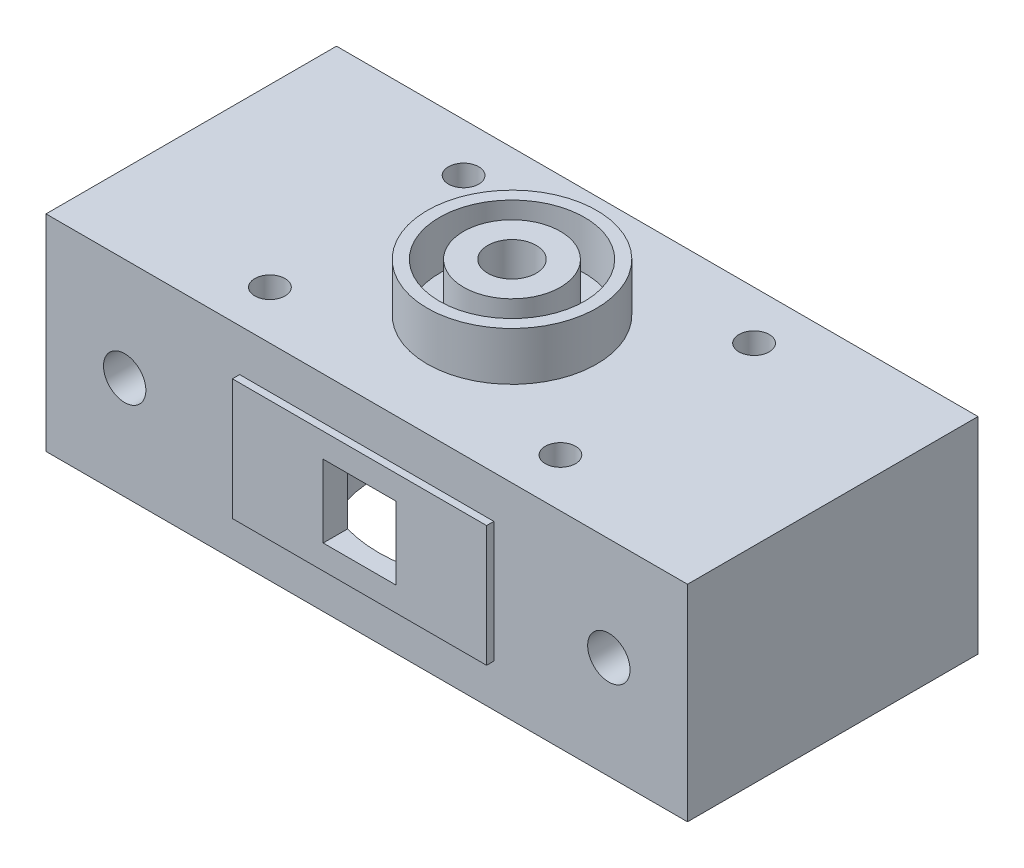
ISO-10303-21;
HEADER;
FILE_DESCRIPTION(('STEP AP214'),'2;1');
FILE_NAME('part.step','',(''),(''),'','','');
FILE_SCHEMA(('AUTOMOTIVE_DESIGN { 1 0 10303 214 1 1 1 1 }'));
ENDSEC;
DATA;
#1=APPLICATION_CONTEXT('core data for automotive mechanical design processes');
#2=APPLICATION_PROTOCOL_DEFINITION('international standard','automotive_design',2000,#1);
#3=PRODUCT_CONTEXT('',#1,'mechanical');
#4=PRODUCT('Part','Part','',(#3));
#5=PRODUCT_RELATED_PRODUCT_CATEGORY('part','',(#4));
#6=PRODUCT_DEFINITION_FORMATION('','',#4);
#7=PRODUCT_DEFINITION_CONTEXT('part definition',#1,'design');
#8=PRODUCT_DEFINITION('design','',#6,#7);
#9=PRODUCT_DEFINITION_SHAPE('','',#8);
#10=(LENGTH_UNIT() NAMED_UNIT(*) SI_UNIT(.MILLI.,.METRE.));
#11=(NAMED_UNIT(*) PLANE_ANGLE_UNIT() SI_UNIT($,.RADIAN.));
#12=(NAMED_UNIT(*) SI_UNIT($,.STERADIAN.) SOLID_ANGLE_UNIT());
#13=UNCERTAINTY_MEASURE_WITH_UNIT(LENGTH_MEASURE(1.E-05),#10,'distance_accuracy_value','');
#14=(GEOMETRIC_REPRESENTATION_CONTEXT(3) GLOBAL_UNCERTAINTY_ASSIGNED_CONTEXT((#13)) GLOBAL_UNIT_ASSIGNED_CONTEXT((#10,
#11,#12)) REPRESENTATION_CONTEXT('',''));
#15=CARTESIAN_POINT('',(0.,0.,0.));
#16=DIRECTION('',(0.,0.,1.));
#17=DIRECTION('',(1.,0.,0.));
#18=AXIS2_PLACEMENT_3D('',#15,#16,#17);
#19=CARTESIAN_POINT('',(26.5,0.,-12.));
#20=DIRECTION('',(0.,1.,0.));
#21=DIRECTION('',(0.,0.,1.));
#22=AXIS2_PLACEMENT_3D('',#19,#20,#21);
#23=PLANE('',#22);
#24=CARTESIAN_POINT('',(0.,0.,0.));
#25=DIRECTION('',(0.,1.,0.));
#26=DIRECTION('',(0.,0.,1.));
#27=AXIS2_PLACEMENT_3D('',#24,#25,#26);
#28=CIRCLE('',#27,6.);
#29=CARTESIAN_POINT('',(0.,0.,6.));
#30=VERTEX_POINT('',#29);
#31=EDGE_CURVE('E12',#30,#30,#28,.F.);
#32=ORIENTED_EDGE('',*,*,#31,.F.);
#33=EDGE_LOOP('',(#32));
#34=FACE_BOUND('',#33,.T.);
#35=CARTESIAN_POINT('',(0.,0.,0.));
#36=DIRECTION('',(0.,1.,0.));
#37=DIRECTION('',(0.,0.,1.));
#38=AXIS2_PLACEMENT_3D('',#35,#36,#37);
#39=CIRCLE('',#38,4.);
#40=CARTESIAN_POINT('',(0.,0.,4.));
#41=VERTEX_POINT('',#40);
#42=EDGE_CURVE('E227',#41,#41,#39,.T.);
#43=ORIENTED_EDGE('',*,*,#42,.F.);
#44=EDGE_LOOP('',(#43));
#45=FACE_BOUND('',#44,.T.);
#46=ADVANCED_FACE('F46',(#34,#45),#23,.T.);
#47=CARTESIAN_POINT('',(12.,0.,-8.));
#48=DIRECTION('',(0.,1.,0.));
#49=DIRECTION('',(0.,0.,1.));
#50=AXIS2_PLACEMENT_3D('',#47,#48,#49);
#51=CIRCLE('',#50,1.24999999999999);
#52=CARTESIAN_POINT('',(12.,0.,-6.75000000000001));
#53=VERTEX_POINT('',#52);
#54=EDGE_CURVE('E205',#53,#53,#51,.T.);
#55=ORIENTED_EDGE('',*,*,#54,.F.);
#56=EDGE_LOOP('',(#55));
#57=FACE_BOUND('',#56,.T.);
#58=CARTESIAN_POINT('',(12.,0.,8.));
#59=DIRECTION('',(0.,1.,0.));
#60=DIRECTION('',(0.,0.,1.));
#61=AXIS2_PLACEMENT_3D('',#58,#59,#60);
#62=CIRCLE('',#61,1.24999999999999);
#63=CARTESIAN_POINT('',(12.,0.,9.24999999999999));
#64=VERTEX_POINT('',#63);
#65=EDGE_CURVE('E204',#64,#64,#62,.T.);
#66=ORIENTED_EDGE('',*,*,#65,.F.);
#67=EDGE_LOOP('',(#66));
#68=FACE_BOUND('',#67,.T.);
#69=CARTESIAN_POINT('',(-12.,0.,8.));
#70=DIRECTION('',(0.,1.,0.));
#71=DIRECTION('',(0.,0.,1.));
#72=AXIS2_PLACEMENT_3D('',#69,#70,#71);
#73=CIRCLE('',#72,1.24999999999999);
#74=CARTESIAN_POINT('',(-12.,0.,9.24999999999999));
#75=VERTEX_POINT('',#74);
#76=EDGE_CURVE('E215',#75,#75,#73,.T.);
#77=ORIENTED_EDGE('',*,*,#76,.F.);
#78=EDGE_LOOP('',(#77));
#79=FACE_BOUND('',#78,.T.);
#80=CARTESIAN_POINT('',(-12.,0.,-8.));
#81=DIRECTION('',(0.,1.,0.));
#82=DIRECTION('',(0.,0.,1.));
#83=AXIS2_PLACEMENT_3D('',#80,#81,#82);
#84=CIRCLE('',#83,1.24999999999999);
#85=CARTESIAN_POINT('',(-12.,0.,-6.75000000000001));
#86=VERTEX_POINT('',#85);
#87=EDGE_CURVE('E221',#86,#86,#84,.T.);
#88=ORIENTED_EDGE('',*,*,#87,.F.);
#89=EDGE_LOOP('',(#88));
#90=FACE_BOUND('',#89,.T.);
#91=DIRECTION('',(-1.,0.,0.));
#92=VECTOR('',#91,1.);
#93=CARTESIAN_POINT('',(26.5,0.,-12.));
#94=LINE('',#93,#92);
#95=CARTESIAN_POINT('',(26.5,0.,-12.));
#96=VERTEX_POINT('',#95);
#97=CARTESIAN_POINT('',(-26.5,0.,-12.));
#98=VERTEX_POINT('',#97);
#99=EDGE_CURVE('E385',#96,#98,#94,.T.);
#100=ORIENTED_EDGE('',*,*,#99,.T.);
#101=DIRECTION('',(0.,0.,1.));
#102=VECTOR('',#101,1.);
#103=CARTESIAN_POINT('',(-26.5,0.,-12.));
#104=LINE('',#103,#102);
#105=CARTESIAN_POINT('',(-26.5,0.,12.));
#106=VERTEX_POINT('',#105);
#107=EDGE_CURVE('E365',#98,#106,#104,.T.);
#108=ORIENTED_EDGE('',*,*,#107,.T.);
#109=DIRECTION('',(-1.,0.,0.));
#110=VECTOR('',#109,1.);
#111=CARTESIAN_POINT('',(26.5,0.,12.));
#112=LINE('',#111,#110);
#113=CARTESIAN_POINT('',(26.5,0.,12.));
#114=VERTEX_POINT('',#113);
#115=EDGE_CURVE('E374',#114,#106,#112,.T.);
#116=ORIENTED_EDGE('',*,*,#115,.F.);
#117=DIRECTION('',(0.,0.,1.));
#118=VECTOR('',#117,1.);
#119=CARTESIAN_POINT('',(26.5,0.,-12.));
#120=LINE('',#119,#118);
#121=EDGE_CURVE('E394',#96,#114,#120,.T.);
#122=ORIENTED_EDGE('',*,*,#121,.F.);
#123=EDGE_LOOP('',(#100,#108,#116,#122));
#124=FACE_BOUND('',#123,.T.);
#125=CARTESIAN_POINT('',(0.,0.,0.));
#126=DIRECTION('',(0.,1.,0.));
#127=DIRECTION('',(0.,0.,1.));
#128=AXIS2_PLACEMENT_3D('',#125,#126,#127);
#129=CIRCLE('',#128,7.);
#130=CARTESIAN_POINT('',(0.,0.,7.));
#131=VERTEX_POINT('',#130);
#132=EDGE_CURVE('E234',#131,#131,#129,.T.);
#133=ORIENTED_EDGE('',*,*,#132,.F.);
#134=EDGE_LOOP('',(#133));
#135=FACE_BOUND('',#134,.T.);
#136=ADVANCED_FACE('F442',(#57,#68,#79,#90,#124,#135),#23,.T.);
#137=CARTESIAN_POINT('',(26.5,-17.,-12.));
#138=DIRECTION('',(0.,-1.,0.));
#139=DIRECTION('',(1.,0.,0.));
#140=AXIS2_PLACEMENT_3D('',#137,#138,#139);
#141=PLANE('',#140);
#142=DIRECTION('',(1.,0.,0.));
#143=VECTOR('',#142,1.);
#144=CARTESIAN_POINT('',(26.5,-17.,12.));
#145=LINE('',#144,#143);
#146=CARTESIAN_POINT('',(-26.5,-17.,12.));
#147=VERTEX_POINT('',#146);
#148=CARTESIAN_POINT('',(26.5,-17.,12.));
#149=VERTEX_POINT('',#148);
#150=EDGE_CURVE('E376',#147,#149,#145,.T.);
#151=ORIENTED_EDGE('',*,*,#150,.F.);
#152=DIRECTION('',(0.,0.,1.));
#153=VECTOR('',#152,1.);
#154=CARTESIAN_POINT('',(-26.5,-17.,-12.));
#155=LINE('',#154,#153);
#156=CARTESIAN_POINT('',(-26.5,-17.,-12.));
#157=VERTEX_POINT('',#156);
#158=EDGE_CURVE('E366',#157,#147,#155,.T.);
#159=ORIENTED_EDGE('',*,*,#158,.F.);
#160=DIRECTION('',(1.,0.,0.));
#161=VECTOR('',#160,1.);
#162=CARTESIAN_POINT('',(26.5,-17.,-12.));
#163=LINE('',#162,#161);
#164=CARTESIAN_POINT('',(26.5,-17.,-12.));
#165=VERTEX_POINT('',#164);
#166=EDGE_CURVE('E387',#157,#165,#163,.T.);
#167=ORIENTED_EDGE('',*,*,#166,.T.);
#168=DIRECTION('',(0.,0.,1.));
#169=VECTOR('',#168,1.);
#170=CARTESIAN_POINT('',(26.5,-17.,-12.));
#171=LINE('',#170,#169);
#172=EDGE_CURVE('E393',#165,#149,#171,.T.);
#173=ORIENTED_EDGE('',*,*,#172,.T.);
#174=EDGE_LOOP('',(#151,#159,#167,#173));
#175=FACE_BOUND('',#174,.T.);
#176=CARTESIAN_POINT('',(0.,-17.,0.));
#177=DIRECTION('',(0.,-1.,0.));
#178=DIRECTION('',(1.,0.,0.));
#179=AXIS2_PLACEMENT_3D('',#176,#177,#178);
#180=CIRCLE('',#179,11.);
#181=CARTESIAN_POINT('',(11.,-17.,0.));
#182=VERTEX_POINT('',#181);
#183=EDGE_CURVE('E248',#182,#182,#180,.T.);
#184=ORIENTED_EDGE('',*,*,#183,.F.);
#185=EDGE_LOOP('',(#184));
#186=FACE_BOUND('',#185,.T.);
#187=ADVANCED_FACE('F447',(#175,#186),#141,.T.);
#188=CARTESIAN_POINT('',(-2.99999999999999,-5.5,-10.8));
#189=DIRECTION('',(-1.,0.,0.));
#190=DIRECTION('',(0.,-1.,0.));
#191=AXIS2_PLACEMENT_3D('',#188,#189,#190);
#192=PLANE('',#191);
#193=DIRECTION('',(0.,0.,-1.));
#194=VECTOR('',#193,1.);
#195=CARTESIAN_POINT('',(-2.99999999999999,-5.5,-10.8));
#196=LINE('',#195,#194);
#197=CARTESIAN_POINT('',(-3.,-5.50000000000001,-10.5830052442584));
#198=VERTEX_POINT('',#197);
#199=CARTESIAN_POINT('',(-2.99999999999999,-5.5,-12.6));
#200=VERTEX_POINT('',#199);
#201=EDGE_CURVE('E68',#198,#200,#196,.T.);
#202=ORIENTED_EDGE('',*,*,#201,.F.);
#203=DIRECTION('',(0.,1.,0.));
#204=VECTOR('',#203,1.);
#205=CARTESIAN_POINT('',(-3.,-48.1126983722081,-10.5830052442584));
#206=LINE('',#205,#204);
#207=CARTESIAN_POINT('',(-3.,-11.5,-10.5830052442584));
#208=VERTEX_POINT('',#207);
#209=EDGE_CURVE('E396',#198,#208,#206,.F.);
#210=ORIENTED_EDGE('',*,*,#209,.T.);
#211=DIRECTION('',(0.,0.,-1.));
#212=VECTOR('',#211,1.);
#213=CARTESIAN_POINT('',(-3.,-11.5,-10.8));
#214=LINE('',#213,#212);
#215=CARTESIAN_POINT('',(-3.,-11.5,-12.6));
#216=VERTEX_POINT('',#215);
#217=EDGE_CURVE('E346',#208,#216,#214,.T.);
#218=ORIENTED_EDGE('',*,*,#217,.T.);
#219=DIRECTION('',(0.,1.,0.));
#220=VECTOR('',#219,1.);
#221=CARTESIAN_POINT('',(-3.,-11.5,-12.6));
#222=LINE('',#221,#220);
#223=EDGE_CURVE('E312',#216,#200,#222,.T.);
#224=ORIENTED_EDGE('',*,*,#223,.T.);
#225=EDGE_LOOP('',(#202,#210,#218,#224));
#226=FACE_BOUND('',#225,.T.);
#227=ADVANCED_FACE('F555',(#226),#192,.F.);
#228=CARTESIAN_POINT('',(3.,-11.5,-10.8));
#229=DIRECTION('',(0.,-1.,0.));
#230=DIRECTION('',(0.,0.,-1.));
#231=AXIS2_PLACEMENT_3D('',#228,#229,#230);
#232=PLANE('',#231);
#233=ORIENTED_EDGE('',*,*,#217,.F.);
#234=CARTESIAN_POINT('',(0.,-11.5,0.));
#235=DIRECTION('',(0.,-1.,0.));
#236=DIRECTION('',(0.,0.,-1.));
#237=AXIS2_PLACEMENT_3D('',#234,#235,#236);
#238=CIRCLE('',#237,11.);
#239=CARTESIAN_POINT('',(3.,-11.5,-10.5830052442584));
#240=VERTEX_POINT('',#239);
#241=EDGE_CURVE('E399',#208,#240,#238,.T.);
#242=ORIENTED_EDGE('',*,*,#241,.T.);
#243=DIRECTION('',(0.,0.,-1.));
#244=VECTOR('',#243,1.);
#245=CARTESIAN_POINT('',(3.,-11.5,-10.8));
#246=LINE('',#245,#244);
#247=CARTESIAN_POINT('',(3.,-11.5,-12.6));
#248=VERTEX_POINT('',#247);
#249=EDGE_CURVE('E349',#240,#248,#246,.T.);
#250=ORIENTED_EDGE('',*,*,#249,.T.);
#251=DIRECTION('',(-1.,0.,0.));
#252=VECTOR('',#251,1.);
#253=CARTESIAN_POINT('',(3.,-11.5,-12.6));
#254=LINE('',#253,#252);
#255=EDGE_CURVE('E309',#248,#216,#254,.T.);
#256=ORIENTED_EDGE('',*,*,#255,.T.);
#257=EDGE_LOOP('',(#233,#242,#250,#256));
#258=FACE_BOUND('',#257,.T.);
#259=ADVANCED_FACE('F560',(#258),#232,.F.);
#260=CARTESIAN_POINT('',(3.00000000000001,-5.5,-10.8));
#261=DIRECTION('',(1.,0.,0.));
#262=DIRECTION('',(0.,1.,0.));
#263=AXIS2_PLACEMENT_3D('',#260,#261,#262);
#264=PLANE('',#263);
#265=ORIENTED_EDGE('',*,*,#249,.F.);
#266=DIRECTION('',(0.,1.,0.));
#267=VECTOR('',#266,1.);
#268=CARTESIAN_POINT('',(3.,-48.1126983722081,-10.5830052442584));
#269=LINE('',#268,#267);
#270=CARTESIAN_POINT('',(3.00000000000001,-5.5,-10.5830052442584));
#271=VERTEX_POINT('',#270);
#272=EDGE_CURVE('E402',#240,#271,#269,.T.);
#273=ORIENTED_EDGE('',*,*,#272,.T.);
#274=DIRECTION('',(0.,0.,-1.));
#275=VECTOR('',#274,1.);
#276=CARTESIAN_POINT('',(3.00000000000001,-5.5,-10.8));
#277=LINE('',#276,#275);
#278=CARTESIAN_POINT('',(3.00000000000001,-5.5,-12.6));
#279=VERTEX_POINT('',#278);
#280=EDGE_CURVE('E351',#271,#279,#277,.T.);
#281=ORIENTED_EDGE('',*,*,#280,.T.);
#282=DIRECTION('',(0.,-1.,0.));
#283=VECTOR('',#282,1.);
#284=CARTESIAN_POINT('',(3.00000000000001,-5.5,-12.6));
#285=LINE('',#284,#283);
#286=EDGE_CURVE('E301',#279,#248,#285,.T.);
#287=ORIENTED_EDGE('',*,*,#286,.T.);
#288=EDGE_LOOP('',(#265,#273,#281,#287));
#289=FACE_BOUND('',#288,.T.);
#290=ADVANCED_FACE('F607',(#289),#264,.F.);
#291=CARTESIAN_POINT('',(3.00000000000001,-5.5,-10.8));
#292=DIRECTION('',(0.,1.,0.));
#293=DIRECTION('',(0.,0.,1.));
#294=AXIS2_PLACEMENT_3D('',#291,#292,#293);
#295=PLANE('',#294);
#296=ORIENTED_EDGE('',*,*,#280,.F.);
#297=CARTESIAN_POINT('',(0.,-5.5,0.));
#298=DIRECTION('',(0.,1.,0.));
#299=DIRECTION('',(0.,0.,1.));
#300=AXIS2_PLACEMENT_3D('',#297,#298,#299);
#301=CIRCLE('',#300,11.);
#302=EDGE_CURVE('E406',#271,#198,#301,.T.);
#303=ORIENTED_EDGE('',*,*,#302,.T.);
#304=ORIENTED_EDGE('',*,*,#201,.T.);
#305=DIRECTION('',(1.,0.,0.));
#306=VECTOR('',#305,1.);
#307=CARTESIAN_POINT('',(-2.99999999999999,-5.5,-12.6));
#308=LINE('',#307,#306);
#309=EDGE_CURVE('E314',#200,#279,#308,.T.);
#310=ORIENTED_EDGE('',*,*,#309,.T.);
#311=EDGE_LOOP('',(#296,#303,#304,#310));
#312=FACE_BOUND('',#311,.T.);
#313=ADVANCED_FACE('F611',(#312),#295,.F.);
#314=CARTESIAN_POINT('',(-2.99999999999999,-5.5,10.8));
#315=DIRECTION('',(1.,0.,0.));
#316=DIRECTION('',(0.,1.,0.));
#317=AXIS2_PLACEMENT_3D('',#314,#315,#316);
#318=PLANE('',#317);
#319=DIRECTION('',(0.,0.,1.));
#320=VECTOR('',#319,1.);
#321=CARTESIAN_POINT('',(-3.,-11.5,10.8));
#322=LINE('',#321,#320);
#323=CARTESIAN_POINT('',(-3.,-11.5,10.5830052442584));
#324=VERTEX_POINT('',#323);
#325=CARTESIAN_POINT('',(-3.,-11.5,12.6));
#326=VERTEX_POINT('',#325);
#327=EDGE_CURVE('E60',#324,#326,#322,.T.);
#328=ORIENTED_EDGE('',*,*,#327,.F.);
#329=DIRECTION('',(0.,1.,0.));
#330=VECTOR('',#329,1.);
#331=CARTESIAN_POINT('',(-3.,-48.1126983722081,10.5830052442584));
#332=LINE('',#331,#330);
#333=CARTESIAN_POINT('',(-2.99999999999999,-5.5,10.5830052442584));
#334=VERTEX_POINT('',#333);
#335=EDGE_CURVE('E408',#324,#334,#332,.T.);
#336=ORIENTED_EDGE('',*,*,#335,.T.);
#337=DIRECTION('',(0.,0.,1.));
#338=VECTOR('',#337,1.);
#339=CARTESIAN_POINT('',(-2.99999999999999,-5.5,10.8));
#340=LINE('',#339,#338);
#341=CARTESIAN_POINT('',(-2.99999999999999,-5.5,12.6));
#342=VERTEX_POINT('',#341);
#343=EDGE_CURVE('E299',#334,#342,#340,.T.);
#344=ORIENTED_EDGE('',*,*,#343,.T.);
#345=DIRECTION('',(0.,1.,0.));
#346=VECTOR('',#345,1.);
#347=CARTESIAN_POINT('',(-3.,-11.5,12.6));
#348=LINE('',#347,#346);
#349=EDGE_CURVE('E260',#326,#342,#348,.T.);
#350=ORIENTED_EDGE('',*,*,#349,.F.);
#351=EDGE_LOOP('',(#328,#336,#344,#350));
#352=FACE_BOUND('',#351,.T.);
#353=ADVANCED_FACE('F423',(#352),#318,.T.);
#354=CARTESIAN_POINT('',(3.00000000000001,-5.5,10.8));
#355=DIRECTION('',(0.,-1.,0.));
#356=DIRECTION('',(0.,0.,-1.));
#357=AXIS2_PLACEMENT_3D('',#354,#355,#356);
#358=PLANE('',#357);
#359=ORIENTED_EDGE('',*,*,#343,.F.);
#360=CARTESIAN_POINT('',(3.00000000000001,-5.5,10.5830052442584));
#361=VERTEX_POINT('',#360);
#362=EDGE_CURVE('E53',#334,#361,#301,.T.);
#363=ORIENTED_EDGE('',*,*,#362,.T.);
#364=DIRECTION('',(0.,0.,1.));
#365=VECTOR('',#364,1.);
#366=CARTESIAN_POINT('',(3.00000000000001,-5.5,10.8));
#367=LINE('',#366,#365);
#368=CARTESIAN_POINT('',(3.00000000000001,-5.5,12.6));
#369=VERTEX_POINT('',#368);
#370=EDGE_CURVE('E302',#361,#369,#367,.T.);
#371=ORIENTED_EDGE('',*,*,#370,.T.);
#372=DIRECTION('',(1.,0.,0.));
#373=VECTOR('',#372,1.);
#374=CARTESIAN_POINT('',(-2.99999999999999,-5.5,12.6));
#375=LINE('',#374,#373);
#376=EDGE_CURVE('E257',#342,#369,#375,.T.);
#377=ORIENTED_EDGE('',*,*,#376,.F.);
#378=EDGE_LOOP('',(#359,#363,#371,#377));
#379=FACE_BOUND('',#378,.T.);
#380=ADVANCED_FACE('F426',(#379),#358,.T.);
#381=CARTESIAN_POINT('',(3.00000000000001,-5.5,10.8));
#382=DIRECTION('',(-1.,0.,0.));
#383=DIRECTION('',(0.,-1.,0.));
#384=AXIS2_PLACEMENT_3D('',#381,#382,#383);
#385=PLANE('',#384);
#386=ORIENTED_EDGE('',*,*,#370,.F.);
#387=DIRECTION('',(0.,1.,0.));
#388=VECTOR('',#387,1.);
#389=CARTESIAN_POINT('',(3.,-48.1126983722081,10.5830052442584));
#390=LINE('',#389,#388);
#391=CARTESIAN_POINT('',(3.,-11.5,10.5830052442584));
#392=VERTEX_POINT('',#391);
#393=EDGE_CURVE('E409',#361,#392,#390,.F.);
#394=ORIENTED_EDGE('',*,*,#393,.T.);
#395=DIRECTION('',(0.,0.,1.));
#396=VECTOR('',#395,1.);
#397=CARTESIAN_POINT('',(3.,-11.5,10.8));
#398=LINE('',#397,#396);
#399=CARTESIAN_POINT('',(3.,-11.5,12.6));
#400=VERTEX_POINT('',#399);
#401=EDGE_CURVE('E304',#392,#400,#398,.T.);
#402=ORIENTED_EDGE('',*,*,#401,.T.);
#403=DIRECTION('',(0.,-1.,0.));
#404=VECTOR('',#403,1.);
#405=CARTESIAN_POINT('',(3.00000000000001,-5.5,12.6));
#406=LINE('',#405,#404);
#407=EDGE_CURVE('E254',#369,#400,#406,.T.);
#408=ORIENTED_EDGE('',*,*,#407,.F.);
#409=EDGE_LOOP('',(#386,#394,#402,#408));
#410=FACE_BOUND('',#409,.T.);
#411=ADVANCED_FACE('F431',(#410),#385,.T.);
#412=CARTESIAN_POINT('',(3.,-11.5,10.8));
#413=DIRECTION('',(0.,1.,0.));
#414=DIRECTION('',(0.,0.,1.));
#415=AXIS2_PLACEMENT_3D('',#412,#413,#414);
#416=PLANE('',#415);
#417=ORIENTED_EDGE('',*,*,#401,.F.);
#418=EDGE_CURVE('E403',#392,#324,#238,.T.);
#419=ORIENTED_EDGE('',*,*,#418,.T.);
#420=ORIENTED_EDGE('',*,*,#327,.T.);
#421=DIRECTION('',(-1.,0.,0.));
#422=VECTOR('',#421,1.);
#423=CARTESIAN_POINT('',(3.,-11.5,12.6));
#424=LINE('',#423,#422);
#425=EDGE_CURVE('E263',#400,#326,#424,.T.);
#426=ORIENTED_EDGE('',*,*,#425,.F.);
#427=EDGE_LOOP('',(#417,#419,#420,#426));
#428=FACE_BOUND('',#427,.T.);
#429=ADVANCED_FACE('F417',(#428),#416,.T.);
#430=CARTESIAN_POINT('',(0.,0.,-12.));
#431=DIRECTION('',(0.,0.,-1.));
#432=DIRECTION('',(-1.,0.,0.));
#433=AXIS2_PLACEMENT_3D('',#430,#431,#432);
#434=PLANE('',#433);
#435=CARTESIAN_POINT('',(-20.,-8.5,-12.));
#436=DIRECTION('',(0.,0.,-1.));
#437=DIRECTION('',(-1.,0.,0.));
#438=AXIS2_PLACEMENT_3D('',#435,#436,#437);
#439=CIRCLE('',#438,1.75);
#440=CARTESIAN_POINT('',(-21.75,-8.5,-12.));
#441=VERTEX_POINT('',#440);
#442=EDGE_CURVE('E359',#441,#441,#439,.T.);
#443=ORIENTED_EDGE('',*,*,#442,.F.);
#444=EDGE_LOOP('',(#443));
#445=FACE_BOUND('',#444,.T.);
#446=CARTESIAN_POINT('',(20.,-8.5,-12.));
#447=DIRECTION('',(0.,0.,1.));
#448=DIRECTION('',(1.,0.,0.));
#449=AXIS2_PLACEMENT_3D('',#446,#447,#448);
#450=CIRCLE('',#449,1.75);
#451=CARTESIAN_POINT('',(21.75,-8.5,-12.));
#452=VERTEX_POINT('',#451);
#453=EDGE_CURVE('E382',#452,#452,#450,.T.);
#454=ORIENTED_EDGE('',*,*,#453,.T.);
#455=EDGE_LOOP('',(#454));
#456=FACE_BOUND('',#455,.T.);
#457=ORIENTED_EDGE('',*,*,#166,.F.);
#458=DIRECTION('',(0.,1.,0.));
#459=VECTOR('',#458,1.);
#460=CARTESIAN_POINT('',(-26.5,0.,-12.));
#461=LINE('',#460,#459);
#462=EDGE_CURVE('E362',#157,#98,#461,.T.);
#463=ORIENTED_EDGE('',*,*,#462,.T.);
#464=ORIENTED_EDGE('',*,*,#99,.F.);
#465=DIRECTION('',(0.,1.,0.));
#466=VECTOR('',#465,1.);
#467=CARTESIAN_POINT('',(26.5,0.,-12.));
#468=LINE('',#467,#466);
#469=EDGE_CURVE('E390',#165,#96,#468,.T.);
#470=ORIENTED_EDGE('',*,*,#469,.F.);
#471=EDGE_LOOP('',(#457,#463,#464,#470));
#472=FACE_BOUND('',#471,.T.);
#473=DIRECTION('',(1.,0.,0.));
#474=VECTOR('',#473,1.);
#475=CARTESIAN_POINT('',(10.5,-3.5,-12.));
#476=LINE('',#475,#474);
#477=CARTESIAN_POINT('',(-10.5,-3.5,-12.));
#478=VERTEX_POINT('',#477);
#479=CARTESIAN_POINT('',(10.5,-3.5,-12.));
#480=VERTEX_POINT('',#479);
#481=EDGE_CURVE('E331',#478,#480,#476,.T.);
#482=ORIENTED_EDGE('',*,*,#481,.F.);
#483=DIRECTION('',(0.,1.,0.));
#484=VECTOR('',#483,1.);
#485=CARTESIAN_POINT('',(-10.5,-3.5,-12.));
#486=LINE('',#485,#484);
#487=CARTESIAN_POINT('',(-10.5,-13.5,-12.));
#488=VERTEX_POINT('',#487);
#489=EDGE_CURVE('E317',#488,#478,#486,.T.);
#490=ORIENTED_EDGE('',*,*,#489,.F.);
#491=DIRECTION('',(-1.,0.,0.));
#492=VECTOR('',#491,1.);
#493=CARTESIAN_POINT('',(10.5,-13.5,-12.));
#494=LINE('',#493,#492);
#495=CARTESIAN_POINT('',(10.5,-13.5,-12.));
#496=VERTEX_POINT('',#495);
#497=EDGE_CURVE('E322',#496,#488,#494,.T.);
#498=ORIENTED_EDGE('',*,*,#497,.F.);
#499=DIRECTION('',(0.,-1.,0.));
#500=VECTOR('',#499,1.);
#501=CARTESIAN_POINT('',(10.5,-3.5,-12.));
#502=LINE('',#501,#500);
#503=EDGE_CURVE('E333',#480,#496,#502,.T.);
#504=ORIENTED_EDGE('',*,*,#503,.F.);
#505=EDGE_LOOP('',(#482,#490,#498,#504));
#506=FACE_BOUND('',#505,.T.);
#507=ADVANCED_FACE('F438',(#445,#456,#472,#506),#434,.T.);
#508=CARTESIAN_POINT('',(26.5,0.,-12.));
#509=DIRECTION('',(1.,0.,0.));
#510=DIRECTION('',(0.,1.,0.));
#511=AXIS2_PLACEMENT_3D('',#508,#509,#510);
#512=PLANE('',#511);
#513=ORIENTED_EDGE('',*,*,#121,.T.);
#514=DIRECTION('',(0.,1.,0.));
#515=VECTOR('',#514,1.);
#516=CARTESIAN_POINT('',(26.5,0.,12.));
#517=LINE('',#516,#515);
#518=EDGE_CURVE('E379',#149,#114,#517,.T.);
#519=ORIENTED_EDGE('',*,*,#518,.F.);
#520=ORIENTED_EDGE('',*,*,#172,.F.);
#521=ORIENTED_EDGE('',*,*,#469,.T.);
#522=EDGE_LOOP('',(#513,#519,#520,#521));
#523=FACE_BOUND('',#522,.T.);
#524=ADVANCED_FACE('F547',(#523),#512,.T.);
#525=CARTESIAN_POINT('',(20.,-8.5,-12.));
#526=DIRECTION('',(0.,0.,1.));
#527=DIRECTION('',(1.,0.,0.));
#528=AXIS2_PLACEMENT_3D('',#525,#526,#527);
#529=CYLINDRICAL_SURFACE('',#528,1.75);
#530=ORIENTED_EDGE('',*,*,#453,.F.);
#531=EDGE_LOOP('',(#530));
#532=FACE_BOUND('',#531,.T.);
#533=CARTESIAN_POINT('',(20.,-8.5,12.));
#534=DIRECTION('',(0.,0.,1.));
#535=DIRECTION('',(1.,0.,0.));
#536=AXIS2_PLACEMENT_3D('',#533,#534,#535);
#537=CIRCLE('',#536,1.75);
#538=CARTESIAN_POINT('',(21.75,-8.5,12.));
#539=VERTEX_POINT('',#538);
#540=EDGE_CURVE('E369',#539,#539,#537,.T.);
#541=ORIENTED_EDGE('',*,*,#540,.T.);
#542=EDGE_LOOP('',(#541));
#543=FACE_BOUND('',#542,.T.);
#544=ADVANCED_FACE('F521',(#532,#543),#529,.F.);
#545=CARTESIAN_POINT('',(0.,0.,12.));
#546=DIRECTION('',(0.,0.,-1.));
#547=DIRECTION('',(-1.,0.,0.));
#548=AXIS2_PLACEMENT_3D('',#545,#546,#547);
#549=PLANE('',#548);
#550=DIRECTION('',(-1.,0.,0.));
#551=VECTOR('',#550,1.);
#552=CARTESIAN_POINT('',(10.5,-13.5,12.));
#553=LINE('',#552,#551);
#554=CARTESIAN_POINT('',(10.5,-13.5,12.));
#555=VERTEX_POINT('',#554);
#556=CARTESIAN_POINT('',(-10.5,-13.5,12.));
#557=VERTEX_POINT('',#556);
#558=EDGE_CURVE('E283',#555,#557,#553,.T.);
#559=ORIENTED_EDGE('',*,*,#558,.T.);
#560=DIRECTION('',(0.,1.,0.));
#561=VECTOR('',#560,1.);
#562=CARTESIAN_POINT('',(-10.5,-3.5,12.));
#563=LINE('',#562,#561);
#564=CARTESIAN_POINT('',(-10.5,-3.5,12.));
#565=VERTEX_POINT('',#564);
#566=EDGE_CURVE('E266',#557,#565,#563,.T.);
#567=ORIENTED_EDGE('',*,*,#566,.T.);
#568=DIRECTION('',(1.,0.,0.));
#569=VECTOR('',#568,1.);
#570=CARTESIAN_POINT('',(10.5,-3.5,12.));
#571=LINE('',#570,#569);
#572=CARTESIAN_POINT('',(10.5,-3.5,12.));
#573=VERTEX_POINT('',#572);
#574=EDGE_CURVE('E271',#565,#573,#571,.T.);
#575=ORIENTED_EDGE('',*,*,#574,.T.);
#576=DIRECTION('',(0.,-1.,0.));
#577=VECTOR('',#576,1.);
#578=CARTESIAN_POINT('',(10.5,-3.5,12.));
#579=LINE('',#578,#577);
#580=EDGE_CURVE('E286',#573,#555,#579,.T.);
#581=ORIENTED_EDGE('',*,*,#580,.T.);
#582=EDGE_LOOP('',(#559,#567,#575,#581));
#583=FACE_BOUND('',#582,.T.);
#584=DIRECTION('',(0.,1.,0.));
#585=VECTOR('',#584,1.);
#586=CARTESIAN_POINT('',(-26.5,0.,12.));
#587=LINE('',#586,#585);
#588=EDGE_CURVE('E356',#147,#106,#587,.T.);
#589=ORIENTED_EDGE('',*,*,#588,.F.);
#590=ORIENTED_EDGE('',*,*,#150,.T.);
#591=ORIENTED_EDGE('',*,*,#518,.T.);
#592=ORIENTED_EDGE('',*,*,#115,.T.);
#593=EDGE_LOOP('',(#589,#590,#591,#592));
#594=FACE_BOUND('',#593,.T.);
#595=ORIENTED_EDGE('',*,*,#540,.F.);
#596=EDGE_LOOP('',(#595));
#597=FACE_BOUND('',#596,.T.);
#598=CARTESIAN_POINT('',(-20.,-8.5,12.));
#599=DIRECTION('',(0.,0.,-1.));
#600=DIRECTION('',(-1.,0.,0.));
#601=AXIS2_PLACEMENT_3D('',#598,#599,#600);
#602=CIRCLE('',#601,1.75);
#603=CARTESIAN_POINT('',(-21.75,-8.5,12.));
#604=VERTEX_POINT('',#603);
#605=EDGE_CURVE('E348',#604,#604,#602,.T.);
#606=ORIENTED_EDGE('',*,*,#605,.T.);
#607=EDGE_LOOP('',(#606));
#608=FACE_BOUND('',#607,.T.);
#609=ADVANCED_FACE('F514',(#583,#594,#597,#608),#549,.F.);
#610=CARTESIAN_POINT('',(-26.5,0.,-12.));
#611=DIRECTION('',(1.,0.,0.));
#612=DIRECTION('',(0.,1.,0.));
#613=AXIS2_PLACEMENT_3D('',#610,#611,#612);
#614=PLANE('',#613);
#615=ORIENTED_EDGE('',*,*,#158,.T.);
#616=ORIENTED_EDGE('',*,*,#588,.T.);
#617=ORIENTED_EDGE('',*,*,#107,.F.);
#618=ORIENTED_EDGE('',*,*,#462,.F.);
#619=EDGE_LOOP('',(#615,#616,#617,#618));
#620=FACE_BOUND('',#619,.T.);
#621=ADVANCED_FACE('F520',(#620),#614,.F.);
#622=CARTESIAN_POINT('',(-20.,-8.5,-12.));
#623=DIRECTION('',(0.,0.,1.));
#624=DIRECTION('',(1.,0.,0.));
#625=AXIS2_PLACEMENT_3D('',#622,#623,#624);
#626=CYLINDRICAL_SURFACE('',#625,1.75);
#627=ORIENTED_EDGE('',*,*,#442,.T.);
#628=EDGE_LOOP('',(#627));
#629=FACE_BOUND('',#628,.T.);
#630=ORIENTED_EDGE('',*,*,#605,.F.);
#631=EDGE_LOOP('',(#630));
#632=FACE_BOUND('',#631,.T.);
#633=ADVANCED_FACE('F529',(#629,#632),#626,.F.);
#634=CARTESIAN_POINT('',(0.,-17.,0.));
#635=DIRECTION('',(0.,1.,0.));
#636=DIRECTION('',(0.,0.,1.));
#637=AXIS2_PLACEMENT_3D('',#634,#635,#636);
#638=CYLINDRICAL_SURFACE('',#637,2.);
#639=CARTESIAN_POINT('',(0.,-2.7,0.));
#640=DIRECTION('',(0.,-1.,0.));
#641=DIRECTION('',(0.,0.,-1.));
#642=AXIS2_PLACEMENT_3D('',#639,#640,#641);
#643=CIRCLE('',#642,2.);
#644=CARTESIAN_POINT('',(0.,-2.7,-2.));
#645=VERTEX_POINT('',#644);
#646=EDGE_CURVE('E251',#645,#645,#643,.F.);
#647=ORIENTED_EDGE('',*,*,#646,.F.);
#648=EDGE_LOOP('',(#647));
#649=FACE_BOUND('',#648,.T.);
#650=CARTESIAN_POINT('',(0.,4.,0.));
#651=DIRECTION('',(0.,1.,0.));
#652=DIRECTION('',(0.,0.,1.));
#653=AXIS2_PLACEMENT_3D('',#650,#651,#652);
#654=CIRCLE('',#653,2.);
#655=CARTESIAN_POINT('',(0.,4.,2.));
#656=VERTEX_POINT('',#655);
#657=EDGE_CURVE('E228',#656,#656,#654,.F.);
#658=ORIENTED_EDGE('',*,*,#657,.F.);
#659=EDGE_LOOP('',(#658));
#660=FACE_BOUND('',#659,.T.);
#661=ADVANCED_FACE('F531',(#649,#660),#638,.F.);
#662=CARTESIAN_POINT('',(0.,0.,-12.6));
#663=DIRECTION('',(0.,0.,-1.));
#664=DIRECTION('',(-1.,0.,0.));
#665=AXIS2_PLACEMENT_3D('',#662,#663,#664);
#666=PLANE('',#665);
#667=DIRECTION('',(0.,1.,0.));
#668=VECTOR('',#667,1.);
#669=CARTESIAN_POINT('',(-10.5,-3.5,-12.6));
#670=LINE('',#669,#668);
#671=CARTESIAN_POINT('',(-10.5,-13.5,-12.6));
#672=VERTEX_POINT('',#671);
#673=CARTESIAN_POINT('',(-10.5,-3.5,-12.6));
#674=VERTEX_POINT('',#673);
#675=EDGE_CURVE('E318',#672,#674,#670,.T.);
#676=ORIENTED_EDGE('',*,*,#675,.T.);
#677=DIRECTION('',(1.,0.,0.));
#678=VECTOR('',#677,1.);
#679=CARTESIAN_POINT('',(10.5,-3.5,-12.6));
#680=LINE('',#679,#678);
#681=CARTESIAN_POINT('',(10.5,-3.5,-12.6));
#682=VERTEX_POINT('',#681);
#683=EDGE_CURVE('E321',#674,#682,#680,.T.);
#684=ORIENTED_EDGE('',*,*,#683,.T.);
#685=DIRECTION('',(0.,-1.,0.));
#686=VECTOR('',#685,1.);
#687=CARTESIAN_POINT('',(10.5,-3.5,-12.6));
#688=LINE('',#687,#686);
#689=CARTESIAN_POINT('',(10.5,-13.5,-12.6));
#690=VERTEX_POINT('',#689);
#691=EDGE_CURVE('E324',#682,#690,#688,.T.);
#692=ORIENTED_EDGE('',*,*,#691,.T.);
#693=DIRECTION('',(-1.,0.,0.));
#694=VECTOR('',#693,1.);
#695=CARTESIAN_POINT('',(10.5,-13.5,-12.6));
#696=LINE('',#695,#694);
#697=EDGE_CURVE('E326',#690,#672,#696,.T.);
#698=ORIENTED_EDGE('',*,*,#697,.T.);
#699=EDGE_LOOP('',(#676,#684,#692,#698));
#700=FACE_BOUND('',#699,.T.);
#701=ORIENTED_EDGE('',*,*,#255,.F.);
#702=ORIENTED_EDGE('',*,*,#286,.F.);
#703=ORIENTED_EDGE('',*,*,#309,.F.);
#704=ORIENTED_EDGE('',*,*,#223,.F.);
#705=EDGE_LOOP('',(#701,#702,#703,#704));
#706=FACE_BOUND('',#705,.T.);
#707=ADVANCED_FACE('F538',(#700,#706),#666,.T.);
#708=CARTESIAN_POINT('',(-10.5,-3.5,-12.6));
#709=DIRECTION('',(1.,0.,0.));
#710=DIRECTION('',(0.,1.,0.));
#711=AXIS2_PLACEMENT_3D('',#708,#709,#710);
#712=PLANE('',#711);
#713=ORIENTED_EDGE('',*,*,#489,.T.);
#714=DIRECTION('',(0.,0.,1.));
#715=VECTOR('',#714,1.);
#716=CARTESIAN_POINT('',(-10.5,-3.5,-12.6));
#717=LINE('',#716,#715);
#718=EDGE_CURVE('E344',#674,#478,#717,.T.);
#719=ORIENTED_EDGE('',*,*,#718,.F.);
#720=ORIENTED_EDGE('',*,*,#675,.F.);
#721=DIRECTION('',(0.,0.,1.));
#722=VECTOR('',#721,1.);
#723=CARTESIAN_POINT('',(-10.5,-13.5,-12.6));
#724=LINE('',#723,#722);
#725=EDGE_CURVE('E328',#672,#488,#724,.T.);
#726=ORIENTED_EDGE('',*,*,#725,.T.);
#727=EDGE_LOOP('',(#713,#719,#720,#726));
#728=FACE_BOUND('',#727,.T.);
#729=ADVANCED_FACE('F594',(#728),#712,.F.);
#730=CARTESIAN_POINT('',(10.5,-3.5,-12.6));
#731=DIRECTION('',(0.,-1.,0.));
#732=DIRECTION('',(0.,0.,-1.));
#733=AXIS2_PLACEMENT_3D('',#730,#731,#732);
#734=PLANE('',#733);
#735=ORIENTED_EDGE('',*,*,#481,.T.);
#736=DIRECTION('',(0.,0.,1.));
#737=VECTOR('',#736,1.);
#738=CARTESIAN_POINT('',(10.5,-3.5,-12.6));
#739=LINE('',#738,#737);
#740=EDGE_CURVE('E341',#682,#480,#739,.T.);
#741=ORIENTED_EDGE('',*,*,#740,.F.);
#742=ORIENTED_EDGE('',*,*,#683,.F.);
#743=ORIENTED_EDGE('',*,*,#718,.T.);
#744=EDGE_LOOP('',(#735,#741,#742,#743));
#745=FACE_BOUND('',#744,.T.);
#746=ADVANCED_FACE('F583',(#745),#734,.F.);
#747=CARTESIAN_POINT('',(10.5,-3.5,-12.6));
#748=DIRECTION('',(-1.,0.,0.));
#749=DIRECTION('',(0.,-1.,0.));
#750=AXIS2_PLACEMENT_3D('',#747,#748,#749);
#751=PLANE('',#750);
#752=ORIENTED_EDGE('',*,*,#503,.T.);
#753=DIRECTION('',(0.,0.,1.));
#754=VECTOR('',#753,1.);
#755=CARTESIAN_POINT('',(10.5,-13.5,-12.6));
#756=LINE('',#755,#754);
#757=EDGE_CURVE('E339',#690,#496,#756,.T.);
#758=ORIENTED_EDGE('',*,*,#757,.F.);
#759=ORIENTED_EDGE('',*,*,#691,.F.);
#760=ORIENTED_EDGE('',*,*,#740,.T.);
#761=EDGE_LOOP('',(#752,#758,#759,#760));
#762=FACE_BOUND('',#761,.T.);
#763=ADVANCED_FACE('F506',(#762),#751,.F.);
#764=CARTESIAN_POINT('',(10.5,-13.5,-12.6));
#765=DIRECTION('',(0.,1.,0.));
#766=DIRECTION('',(0.,0.,1.));
#767=AXIS2_PLACEMENT_3D('',#764,#765,#766);
#768=PLANE('',#767);
#769=ORIENTED_EDGE('',*,*,#497,.T.);
#770=ORIENTED_EDGE('',*,*,#725,.F.);
#771=ORIENTED_EDGE('',*,*,#697,.F.);
#772=ORIENTED_EDGE('',*,*,#757,.T.);
#773=EDGE_LOOP('',(#769,#770,#771,#772));
#774=FACE_BOUND('',#773,.T.);
#775=ADVANCED_FACE('F501',(#774),#768,.F.);
#776=CARTESIAN_POINT('',(-10.5,-3.5,12.6));
#777=DIRECTION('',(-1.,0.,0.));
#778=DIRECTION('',(0.,-1.,0.));
#779=AXIS2_PLACEMENT_3D('',#776,#777,#778);
#780=PLANE('',#779);
#781=ORIENTED_EDGE('',*,*,#566,.F.);
#782=DIRECTION('',(0.,0.,-1.));
#783=VECTOR('',#782,1.);
#784=CARTESIAN_POINT('',(-10.5,-13.5,12.6));
#785=LINE('',#784,#783);
#786=CARTESIAN_POINT('',(-10.5,-13.5,12.6));
#787=VERTEX_POINT('',#786);
#788=EDGE_CURVE('E297',#787,#557,#785,.T.);
#789=ORIENTED_EDGE('',*,*,#788,.F.);
#790=DIRECTION('',(0.,1.,0.));
#791=VECTOR('',#790,1.);
#792=CARTESIAN_POINT('',(-10.5,-3.5,12.6));
#793=LINE('',#792,#791);
#794=CARTESIAN_POINT('',(-10.5,-3.5,12.6));
#795=VERTEX_POINT('',#794);
#796=EDGE_CURVE('E267',#787,#795,#793,.T.);
#797=ORIENTED_EDGE('',*,*,#796,.T.);
#798=DIRECTION('',(0.,0.,-1.));
#799=VECTOR('',#798,1.);
#800=CARTESIAN_POINT('',(-10.5,-3.5,12.6));
#801=LINE('',#800,#799);
#802=EDGE_CURVE('E280',#795,#565,#801,.T.);
#803=ORIENTED_EDGE('',*,*,#802,.T.);
#804=EDGE_LOOP('',(#781,#789,#797,#803));
#805=FACE_BOUND('',#804,.T.);
#806=ADVANCED_FACE('F498',(#805),#780,.T.);
#807=CARTESIAN_POINT('',(10.5,-13.5,12.6));
#808=DIRECTION('',(0.,-1.,0.));
#809=DIRECTION('',(0.,0.,-1.));
#810=AXIS2_PLACEMENT_3D('',#807,#808,#809);
#811=PLANE('',#810);
#812=ORIENTED_EDGE('',*,*,#558,.F.);
#813=DIRECTION('',(0.,0.,-1.));
#814=VECTOR('',#813,1.);
#815=CARTESIAN_POINT('',(10.5,-13.5,12.6));
#816=LINE('',#815,#814);
#817=CARTESIAN_POINT('',(10.5,-13.5,12.6));
#818=VERTEX_POINT('',#817);
#819=EDGE_CURVE('E295',#818,#555,#816,.T.);
#820=ORIENTED_EDGE('',*,*,#819,.F.);
#821=DIRECTION('',(-1.,0.,0.));
#822=VECTOR('',#821,1.);
#823=CARTESIAN_POINT('',(10.5,-13.5,12.6));
#824=LINE('',#823,#822);
#825=EDGE_CURVE('E270',#818,#787,#824,.T.);
#826=ORIENTED_EDGE('',*,*,#825,.T.);
#827=ORIENTED_EDGE('',*,*,#788,.T.);
#828=EDGE_LOOP('',(#812,#820,#826,#827));
#829=FACE_BOUND('',#828,.T.);
#830=ADVANCED_FACE('F494',(#829),#811,.T.);
#831=CARTESIAN_POINT('',(10.5,-3.5,12.6));
#832=DIRECTION('',(1.,0.,0.));
#833=DIRECTION('',(0.,1.,0.));
#834=AXIS2_PLACEMENT_3D('',#831,#832,#833);
#835=PLANE('',#834);
#836=ORIENTED_EDGE('',*,*,#580,.F.);
#837=DIRECTION('',(0.,0.,-1.));
#838=VECTOR('',#837,1.);
#839=CARTESIAN_POINT('',(10.5,-3.5,12.6));
#840=LINE('',#839,#838);
#841=CARTESIAN_POINT('',(10.5,-3.5,12.6));
#842=VERTEX_POINT('',#841);
#843=EDGE_CURVE('E292',#842,#573,#840,.T.);
#844=ORIENTED_EDGE('',*,*,#843,.F.);
#845=DIRECTION('',(0.,-1.,0.));
#846=VECTOR('',#845,1.);
#847=CARTESIAN_POINT('',(10.5,-3.5,12.6));
#848=LINE('',#847,#846);
#849=EDGE_CURVE('E274',#842,#818,#848,.T.);
#850=ORIENTED_EDGE('',*,*,#849,.T.);
#851=ORIENTED_EDGE('',*,*,#819,.T.);
#852=EDGE_LOOP('',(#836,#844,#850,#851));
#853=FACE_BOUND('',#852,.T.);
#854=ADVANCED_FACE('F490',(#853),#835,.T.);
#855=CARTESIAN_POINT('',(10.5,-3.5,12.6));
#856=DIRECTION('',(0.,1.,0.));
#857=DIRECTION('',(0.,0.,1.));
#858=AXIS2_PLACEMENT_3D('',#855,#856,#857);
#859=PLANE('',#858);
#860=ORIENTED_EDGE('',*,*,#574,.F.);
#861=ORIENTED_EDGE('',*,*,#802,.F.);
#862=DIRECTION('',(1.,0.,0.));
#863=VECTOR('',#862,1.);
#864=CARTESIAN_POINT('',(10.5,-3.5,12.6));
#865=LINE('',#864,#863);
#866=EDGE_CURVE('E277',#795,#842,#865,.T.);
#867=ORIENTED_EDGE('',*,*,#866,.T.);
#868=ORIENTED_EDGE('',*,*,#843,.T.);
#869=EDGE_LOOP('',(#860,#861,#867,#868));
#870=FACE_BOUND('',#869,.T.);
#871=ADVANCED_FACE('F487',(#870),#859,.T.);
#872=CARTESIAN_POINT('',(0.,0.,12.6));
#873=DIRECTION('',(0.,0.,1.));
#874=DIRECTION('',(-1.,0.,0.));
#875=AXIS2_PLACEMENT_3D('',#872,#873,#874);
#876=PLANE('',#875);
#877=ORIENTED_EDGE('',*,*,#407,.T.);
#878=ORIENTED_EDGE('',*,*,#425,.T.);
#879=ORIENTED_EDGE('',*,*,#349,.T.);
#880=ORIENTED_EDGE('',*,*,#376,.T.);
#881=EDGE_LOOP('',(#877,#878,#879,#880));
#882=FACE_BOUND('',#881,.T.);
#883=ORIENTED_EDGE('',*,*,#796,.F.);
#884=ORIENTED_EDGE('',*,*,#825,.F.);
#885=ORIENTED_EDGE('',*,*,#849,.F.);
#886=ORIENTED_EDGE('',*,*,#866,.F.);
#887=EDGE_LOOP('',(#883,#884,#885,#886));
#888=FACE_BOUND('',#887,.T.);
#889=ADVANCED_FACE('F429',(#882,#888),#876,.T.);
#890=CARTESIAN_POINT('',(0.,-2.7,0.));
#891=DIRECTION('',(0.,-1.,0.));
#892=DIRECTION('',(0.,0.,-1.));
#893=AXIS2_PLACEMENT_3D('',#890,#891,#892);
#894=PLANE('',#893);
#895=CARTESIAN_POINT('',(0.,-2.7,0.));
#896=DIRECTION('',(0.,-1.,0.));
#897=DIRECTION('',(0.,0.,-1.));
#898=AXIS2_PLACEMENT_3D('',#895,#896,#897);
#899=CIRCLE('',#898,11.);
#900=CARTESIAN_POINT('',(0.,-2.7,-11.));
#901=VERTEX_POINT('',#900);
#902=EDGE_CURVE('E243',#901,#901,#899,.T.);
#903=ORIENTED_EDGE('',*,*,#902,.T.);
#904=EDGE_LOOP('',(#903));
#905=FACE_BOUND('',#904,.T.);
#906=ORIENTED_EDGE('',*,*,#646,.T.);
#907=EDGE_LOOP('',(#906));
#908=FACE_BOUND('',#907,.T.);
#909=ADVANCED_FACE('F479',(#905,#908),#894,.T.);
#910=CARTESIAN_POINT('',(0.,-48.1126983722081,0.));
#911=DIRECTION('',(0.,1.,0.));
#912=DIRECTION('',(0.,0.,1.));
#913=AXIS2_PLACEMENT_3D('',#910,#911,#912);
#914=CYLINDRICAL_SURFACE('',#913,11.);
#915=ORIENTED_EDGE('',*,*,#362,.F.);
#916=ORIENTED_EDGE('',*,*,#335,.F.);
#917=ORIENTED_EDGE('',*,*,#418,.F.);
#918=ORIENTED_EDGE('',*,*,#393,.F.);
#919=EDGE_LOOP('',(#915,#916,#917,#918));
#920=FACE_BOUND('',#919,.T.);
#921=ORIENTED_EDGE('',*,*,#302,.F.);
#922=ORIENTED_EDGE('',*,*,#272,.F.);
#923=ORIENTED_EDGE('',*,*,#241,.F.);
#924=ORIENTED_EDGE('',*,*,#209,.F.);
#925=EDGE_LOOP('',(#921,#922,#923,#924));
#926=FACE_BOUND('',#925,.T.);
#927=ORIENTED_EDGE('',*,*,#902,.F.);
#928=EDGE_LOOP('',(#927));
#929=FACE_BOUND('',#928,.T.);
#930=ORIENTED_EDGE('',*,*,#183,.T.);
#931=EDGE_LOOP('',(#930));
#932=FACE_BOUND('',#931,.T.);
#933=ADVANCED_FACE('F421',(#920,#926,#929,#932),#914,.F.);
#934=CARTESIAN_POINT('',(0.,4.,0.));
#935=DIRECTION('',(0.,-1.,0.));
#936=DIRECTION('',(0.,0.,-1.));
#937=AXIS2_PLACEMENT_3D('',#934,#935,#936);
#938=CYLINDRICAL_SURFACE('',#937,6.);
#939=CARTESIAN_POINT('',(0.,4.,0.));
#940=DIRECTION('',(0.,1.,0.));
#941=DIRECTION('',(0.,0.,1.));
#942=AXIS2_PLACEMENT_3D('',#939,#940,#941);
#943=CIRCLE('',#942,6.);
#944=CARTESIAN_POINT('',(0.,4.,6.));
#945=VERTEX_POINT('',#944);
#946=EDGE_CURVE('E237',#945,#945,#943,.T.);
#947=ORIENTED_EDGE('',*,*,#946,.T.);
#948=EDGE_LOOP('',(#947));
#949=FACE_BOUND('',#948,.T.);
#950=ORIENTED_EDGE('',*,*,#31,.T.);
#951=EDGE_LOOP('',(#950));
#952=FACE_BOUND('',#951,.T.);
#953=ADVANCED_FACE('F474',(#949,#952),#938,.F.);
#954=CARTESIAN_POINT('',(0.,4.,0.));
#955=DIRECTION('',(0.,-1.,0.));
#956=DIRECTION('',(0.,0.,-1.));
#957=AXIS2_PLACEMENT_3D('',#954,#955,#956);
#958=CYLINDRICAL_SURFACE('',#957,7.);
#959=CARTESIAN_POINT('',(0.,4.,0.));
#960=DIRECTION('',(0.,1.,0.));
#961=DIRECTION('',(0.,0.,1.));
#962=AXIS2_PLACEMENT_3D('',#959,#960,#961);
#963=CIRCLE('',#962,7.);
#964=CARTESIAN_POINT('',(0.,4.,7.));
#965=VERTEX_POINT('',#964);
#966=EDGE_CURVE('E240',#965,#965,#963,.T.);
#967=ORIENTED_EDGE('',*,*,#966,.F.);
#968=EDGE_LOOP('',(#967));
#969=FACE_BOUND('',#968,.T.);
#970=ORIENTED_EDGE('',*,*,#132,.T.);
#971=EDGE_LOOP('',(#970));
#972=FACE_BOUND('',#971,.T.);
#973=ADVANCED_FACE('F466',(#969,#972),#958,.T.);
#974=CARTESIAN_POINT('',(0.,4.,0.));
#975=DIRECTION('',(0.,1.,0.));
#976=DIRECTION('',(0.,0.,1.));
#977=AXIS2_PLACEMENT_3D('',#974,#975,#976);
#978=PLANE('',#977);
#979=ORIENTED_EDGE('',*,*,#946,.F.);
#980=EDGE_LOOP('',(#979));
#981=FACE_BOUND('',#980,.T.);
#982=ORIENTED_EDGE('',*,*,#966,.T.);
#983=EDGE_LOOP('',(#982));
#984=FACE_BOUND('',#983,.T.);
#985=ADVANCED_FACE('F456',(#981,#984),#978,.T.);
#986=CARTESIAN_POINT('',(0.,4.,0.));
#987=DIRECTION('',(0.,-1.,0.));
#988=DIRECTION('',(0.,0.,-1.));
#989=AXIS2_PLACEMENT_3D('',#986,#987,#988);
#990=CYLINDRICAL_SURFACE('',#989,4.);
#991=CARTESIAN_POINT('',(0.,4.,0.));
#992=DIRECTION('',(0.,1.,0.));
#993=DIRECTION('',(0.,0.,1.));
#994=AXIS2_PLACEMENT_3D('',#991,#992,#993);
#995=CIRCLE('',#994,4.);
#996=CARTESIAN_POINT('',(0.,4.,4.));
#997=VERTEX_POINT('',#996);
#998=EDGE_CURVE('E231',#997,#997,#995,.T.);
#999=ORIENTED_EDGE('',*,*,#998,.F.);
#1000=EDGE_LOOP('',(#999));
#1001=FACE_BOUND('',#1000,.T.);
#1002=ORIENTED_EDGE('',*,*,#42,.T.);
#1003=EDGE_LOOP('',(#1002));
#1004=FACE_BOUND('',#1003,.T.);
#1005=ADVANCED_FACE('F453',(#1001,#1004),#990,.T.);
#1006=CARTESIAN_POINT('',(0.,4.,0.));
#1007=DIRECTION('',(0.,1.,0.));
#1008=DIRECTION('',(0.,0.,1.));
#1009=AXIS2_PLACEMENT_3D('',#1006,#1007,#1008);
#1010=PLANE('',#1009);
#1011=ORIENTED_EDGE('',*,*,#657,.T.);
#1012=EDGE_LOOP('',(#1011));
#1013=FACE_BOUND('',#1012,.T.);
#1014=ORIENTED_EDGE('',*,*,#998,.T.);
#1015=EDGE_LOOP('',(#1014));
#1016=FACE_BOUND('',#1015,.T.);
#1017=ADVANCED_FACE('F455',(#1013,#1016),#1010,.T.);
#1018=CARTESIAN_POINT('',(-12.,-11.5,-8.));
#1019=DIRECTION('',(0.,1.,0.));
#1020=DIRECTION('',(0.,0.,1.));
#1021=AXIS2_PLACEMENT_3D('',#1018,#1019,#1020);
#1022=CONICAL_SURFACE('',#1021,1.25,1.02974425867665);
#1023=CARTESIAN_POINT('',(-12.,-12.2510757737845,-8.));
#1024=VERTEX_POINT('',#1023);
#1025=VERTEX_LOOP('',#1024);
#1026=FACE_BOUND('',#1025,.T.);
#1027=CARTESIAN_POINT('',(-12.,-11.5,-8.));
#1028=DIRECTION('',(0.,1.,0.));
#1029=DIRECTION('',(0.,0.,1.));
#1030=AXIS2_PLACEMENT_3D('',#1027,#1028,#1029);
#1031=CIRCLE('',#1030,1.25);
#1032=CARTESIAN_POINT('',(-12.,-11.5,-6.75));
#1033=VERTEX_POINT('',#1032);
#1034=EDGE_CURVE('E224',#1033,#1033,#1031,.T.);
#1035=ORIENTED_EDGE('',*,*,#1034,.T.);
#1036=EDGE_LOOP('',(#1035));
#1037=FACE_BOUND('',#1036,.T.);
#1038=ADVANCED_FACE('F463',(#1026,#1037),#1022,.F.);
#1039=CARTESIAN_POINT('',(-12.,0.,-8.));
#1040=DIRECTION('',(0.,1.,0.));
#1041=DIRECTION('',(0.,0.,1.));
#1042=AXIS2_PLACEMENT_3D('',#1039,#1040,#1041);
#1043=CYLINDRICAL_SURFACE('',#1042,1.24999999999999);
#1044=ORIENTED_EDGE('',*,*,#1034,.F.);
#1045=EDGE_LOOP('',(#1044));
#1046=FACE_BOUND('',#1045,.T.);
#1047=ORIENTED_EDGE('',*,*,#87,.T.);
#1048=EDGE_LOOP('',(#1047));
#1049=FACE_BOUND('',#1048,.T.);
#1050=ADVANCED_FACE('F804',(#1046,#1049),#1043,.F.);
#1051=CARTESIAN_POINT('',(-12.,-11.5,8.));
#1052=DIRECTION('',(0.,1.,0.));
#1053=DIRECTION('',(0.,0.,1.));
#1054=AXIS2_PLACEMENT_3D('',#1051,#1052,#1053);
#1055=CONICAL_SURFACE('',#1054,1.25,1.02974425867665);
#1056=CARTESIAN_POINT('',(-12.,-12.2510757737845,8.));
#1057=VERTEX_POINT('',#1056);
#1058=VERTEX_LOOP('',#1057);
#1059=FACE_BOUND('',#1058,.T.);
#1060=CARTESIAN_POINT('',(-12.,-11.5,8.));
#1061=DIRECTION('',(0.,1.,0.));
#1062=DIRECTION('',(0.,0.,1.));
#1063=AXIS2_PLACEMENT_3D('',#1060,#1061,#1062);
#1064=CIRCLE('',#1063,1.25);
#1065=CARTESIAN_POINT('',(-12.,-11.5,9.25));
#1066=VERTEX_POINT('',#1065);
#1067=EDGE_CURVE('E218',#1066,#1066,#1064,.T.);
#1068=ORIENTED_EDGE('',*,*,#1067,.T.);
#1069=EDGE_LOOP('',(#1068));
#1070=FACE_BOUND('',#1069,.T.);
#1071=ADVANCED_FACE('F814',(#1059,#1070),#1055,.F.);
#1072=CARTESIAN_POINT('',(-12.,0.,8.));
#1073=DIRECTION('',(0.,1.,0.));
#1074=DIRECTION('',(0.,0.,1.));
#1075=AXIS2_PLACEMENT_3D('',#1072,#1073,#1074);
#1076=CYLINDRICAL_SURFACE('',#1075,1.24999999999999);
#1077=ORIENTED_EDGE('',*,*,#1067,.F.);
#1078=EDGE_LOOP('',(#1077));
#1079=FACE_BOUND('',#1078,.T.);
#1080=ORIENTED_EDGE('',*,*,#76,.T.);
#1081=EDGE_LOOP('',(#1080));
#1082=FACE_BOUND('',#1081,.T.);
#1083=ADVANCED_FACE('F826',(#1079,#1082),#1076,.F.);
#1084=CARTESIAN_POINT('',(12.,-11.5,8.));
#1085=DIRECTION('',(0.,1.,0.));
#1086=DIRECTION('',(0.,0.,1.));
#1087=AXIS2_PLACEMENT_3D('',#1084,#1085,#1086);
#1088=CONICAL_SURFACE('',#1087,1.25,1.02974425867665);
#1089=CARTESIAN_POINT('',(12.,-12.2510757737845,8.));
#1090=VERTEX_POINT('',#1089);
#1091=VERTEX_LOOP('',#1090);
#1092=FACE_BOUND('',#1091,.T.);
#1093=CARTESIAN_POINT('',(12.,-11.5,8.));
#1094=DIRECTION('',(0.,1.,0.));
#1095=DIRECTION('',(0.,0.,1.));
#1096=AXIS2_PLACEMENT_3D('',#1093,#1094,#1095);
#1097=CIRCLE('',#1096,1.25);
#1098=CARTESIAN_POINT('',(12.,-11.5,9.25));
#1099=VERTEX_POINT('',#1098);
#1100=EDGE_CURVE('E208',#1099,#1099,#1097,.T.);
#1101=ORIENTED_EDGE('',*,*,#1100,.T.);
#1102=EDGE_LOOP('',(#1101));
#1103=FACE_BOUND('',#1102,.T.);
#1104=ADVANCED_FACE('F836',(#1092,#1103),#1088,.F.);
#1105=CARTESIAN_POINT('',(12.,0.,8.));
#1106=DIRECTION('',(0.,1.,0.));
#1107=DIRECTION('',(0.,0.,1.));
#1108=AXIS2_PLACEMENT_3D('',#1105,#1106,#1107);
#1109=CYLINDRICAL_SURFACE('',#1108,1.24999999999999);
#1110=ORIENTED_EDGE('',*,*,#1100,.F.);
#1111=EDGE_LOOP('',(#1110));
#1112=FACE_BOUND('',#1111,.T.);
#1113=ORIENTED_EDGE('',*,*,#65,.T.);
#1114=EDGE_LOOP('',(#1113));
#1115=FACE_BOUND('',#1114,.T.);
#1116=ADVANCED_FACE('F198',(#1112,#1115),#1109,.F.);
#1117=CARTESIAN_POINT('',(12.,-11.5,-8.));
#1118=DIRECTION('',(0.,1.,0.));
#1119=DIRECTION('',(0.,0.,1.));
#1120=AXIS2_PLACEMENT_3D('',#1117,#1118,#1119);
#1121=CONICAL_SURFACE('',#1120,1.25,1.02974425867665);
#1122=CARTESIAN_POINT('',(12.,-12.2510757737845,-8.));
#1123=VERTEX_POINT('',#1122);
#1124=VERTEX_LOOP('',#1123);
#1125=FACE_BOUND('',#1124,.T.);
#1126=CARTESIAN_POINT('',(12.,-11.5,-8.));
#1127=DIRECTION('',(0.,1.,0.));
#1128=DIRECTION('',(0.,0.,1.));
#1129=AXIS2_PLACEMENT_3D('',#1126,#1127,#1128);
#1130=CIRCLE('',#1129,1.25);
#1131=CARTESIAN_POINT('',(12.,-11.5,-6.75));
#1132=VERTEX_POINT('',#1131);
#1133=EDGE_CURVE('E202',#1132,#1132,#1130,.T.);
#1134=ORIENTED_EDGE('',*,*,#1133,.T.);
#1135=EDGE_LOOP('',(#1134));
#1136=FACE_BOUND('',#1135,.T.);
#1137=ADVANCED_FACE('F194',(#1125,#1136),#1121,.F.);
#1138=CARTESIAN_POINT('',(12.,0.,-8.));
#1139=DIRECTION('',(0.,1.,0.));
#1140=DIRECTION('',(0.,0.,1.));
#1141=AXIS2_PLACEMENT_3D('',#1138,#1139,#1140);
#1142=CYLINDRICAL_SURFACE('',#1141,1.24999999999999);
#1143=ORIENTED_EDGE('',*,*,#1133,.F.);
#1144=EDGE_LOOP('',(#1143));
#1145=FACE_BOUND('',#1144,.T.);
#1146=ORIENTED_EDGE('',*,*,#54,.T.);
#1147=EDGE_LOOP('',(#1146));
#1148=FACE_BOUND('',#1147,.T.);
#1149=ADVANCED_FACE('F197',(#1145,#1148),#1142,.F.);
#1150=CLOSED_SHELL('',(#46,#136,#187,#227,#259,#290,#313,#353,#380,#411,#429,#507,#524,#544,
#609,#621,#633,#661,#707,#729,#746,#763,#775,#806,#830,#854,#871,#889,#909,#933,#953,#973,#985,
#1005,#1017,#1038,#1050,#1071,#1083,#1104,#1116,#1137,#1149));
#1151=MANIFOLD_SOLID_BREP('B2',#1150);
#1152=ADVANCED_BREP_SHAPE_REPRESENTATION('',(#18,#1151),#14);
#1153=SHAPE_DEFINITION_REPRESENTATION(#9,#1152);
ENDSEC;
END-ISO-10303-21;
